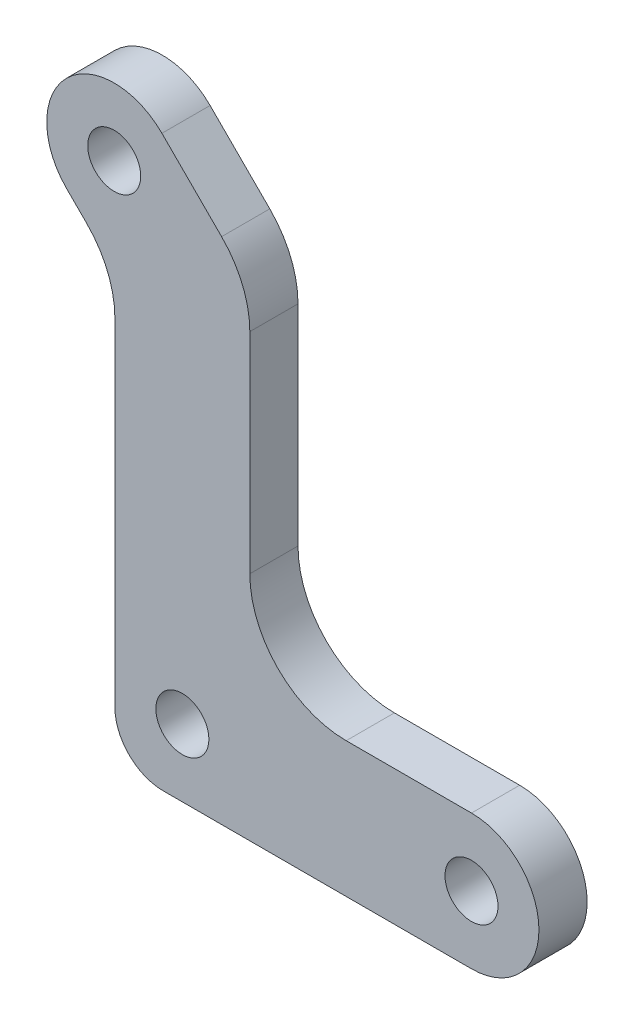
ISO-10303-21;
HEADER;
FILE_DESCRIPTION(('STEP AP214'),'2;1');
FILE_NAME('part.step','',(''),(''),'','','');
FILE_SCHEMA(('AUTOMOTIVE_DESIGN { 1 0 10303 214 1 1 1 1 }'));
ENDSEC;
DATA;
#1=APPLICATION_CONTEXT('core data for automotive mechanical design processes');
#2=APPLICATION_PROTOCOL_DEFINITION('international standard','automotive_design',2000,#1);
#3=PRODUCT_CONTEXT('',#1,'mechanical');
#4=PRODUCT('Part','Part','',(#3));
#5=PRODUCT_RELATED_PRODUCT_CATEGORY('part','',(#4));
#6=PRODUCT_DEFINITION_FORMATION('','',#4);
#7=PRODUCT_DEFINITION_CONTEXT('part definition',#1,'design');
#8=PRODUCT_DEFINITION('design','',#6,#7);
#9=PRODUCT_DEFINITION_SHAPE('','',#8);
#10=(LENGTH_UNIT() NAMED_UNIT(*) SI_UNIT(.MILLI.,.METRE.));
#11=(NAMED_UNIT(*) PLANE_ANGLE_UNIT() SI_UNIT($,.RADIAN.));
#12=(NAMED_UNIT(*) SI_UNIT($,.STERADIAN.) SOLID_ANGLE_UNIT());
#13=UNCERTAINTY_MEASURE_WITH_UNIT(LENGTH_MEASURE(1.E-05),#10,'distance_accuracy_value','');
#14=(GEOMETRIC_REPRESENTATION_CONTEXT(3) GLOBAL_UNCERTAINTY_ASSIGNED_CONTEXT((#13)) GLOBAL_UNIT_ASSIGNED_CONTEXT((#10,
#11,#12)) REPRESENTATION_CONTEXT('',''));
#15=CARTESIAN_POINT('',(0.,0.,0.));
#16=DIRECTION('',(0.,0.,1.));
#17=DIRECTION('',(1.,0.,0.));
#18=AXIS2_PLACEMENT_3D('',#15,#16,#17);
#19=CARTESIAN_POINT('',(-3.,38.7573593128807,5.));
#20=DIRECTION('',(0.,0.,1.));
#21=DIRECTION('',(1.,0.,0.));
#22=AXIS2_PLACEMENT_3D('',#19,#20,#21);
#23=PLANE('',#22);
#24=CARTESIAN_POINT('',(-7.07106781186552,47.0710678118654,5.));
#25=DIRECTION('',(0.,0.,1.));
#26=DIRECTION('',(1.,0.,0.));
#27=AXIS2_PLACEMENT_3D('',#24,#25,#26);
#28=CIRCLE('',#27,2.75);
#29=CARTESIAN_POINT('',(-4.32106781186552,47.0710678118654,5.));
#30=VERTEX_POINT('',#29);
#31=EDGE_CURVE('E400',#30,#30,#28,.T.);
#32=ORIENTED_EDGE('',*,*,#31,.F.);
#33=EDGE_LOOP('',(#32));
#34=FACE_BOUND('',#33,.T.);
#35=CARTESIAN_POINT('',(-3.,38.7573593128807,5.));
#36=DIRECTION('',(0.,0.,1.));
#37=DIRECTION('',(1.,0.,0.));
#38=AXIS2_PLACEMENT_3D('',#35,#36,#37);
#39=CIRCLE('',#38,10.);
#40=CARTESIAN_POINT('',(7.,38.7573593128807,5.));
#41=VERTEX_POINT('',#40);
#42=CARTESIAN_POINT('',(4.07106781186541,45.8284271247463,5.));
#43=VERTEX_POINT('',#42);
#44=EDGE_CURVE('E305',#41,#43,#39,.T.);
#45=ORIENTED_EDGE('',*,*,#44,.T.);
#46=DIRECTION('',(-0.707106781186551,0.707106781186544,0.));
#47=VECTOR('',#46,1.);
#48=CARTESIAN_POINT('',(4.07106781186541,45.8284271247463,5.));
#49=LINE('',#48,#47);
#50=CARTESIAN_POINT('',(-2.12132034355971,52.0208152801713,5.));
#51=VERTEX_POINT('',#50);
#52=EDGE_CURVE('E218',#43,#51,#49,.T.);
#53=ORIENTED_EDGE('',*,*,#52,.T.);
#54=CARTESIAN_POINT('',(-7.07106781186552,47.0710678118654,5.));
#55=DIRECTION('',(0.,0.,1.));
#56=DIRECTION('',(1.,0.,0.));
#57=AXIS2_PLACEMENT_3D('',#54,#55,#56);
#58=CIRCLE('',#57,7.);
#59=CARTESIAN_POINT('',(-12.0208152801713,42.1213203435596,5.));
#60=VERTEX_POINT('',#59);
#61=EDGE_CURVE('E326',#51,#60,#58,.T.);
#62=ORIENTED_EDGE('',*,*,#61,.T.);
#63=DIRECTION('',(-0.707106781186551,0.707106781186544,0.));
#64=VECTOR('',#63,1.);
#65=CARTESIAN_POINT('',(-9.92893218813459,40.0294372515229,5.));
#66=LINE('',#65,#64);
#67=CARTESIAN_POINT('',(-9.92893218813459,40.0294372515229,5.));
#68=VERTEX_POINT('',#67);
#69=EDGE_CURVE('E337',#68,#60,#66,.T.);
#70=ORIENTED_EDGE('',*,*,#69,.F.);
#71=CARTESIAN_POINT('',(-17.,32.9583694396573,5.));
#72=DIRECTION('',(0.,0.,1.));
#73=DIRECTION('',(1.,0.,0.));
#74=AXIS2_PLACEMENT_3D('',#71,#72,#73);
#75=CIRCLE('',#74,10.);
#76=CARTESIAN_POINT('',(-7.,32.9583694396573,5.));
#77=VERTEX_POINT('',#76);
#78=EDGE_CURVE('E340',#77,#68,#75,.T.);
#79=ORIENTED_EDGE('',*,*,#78,.F.);
#80=DIRECTION('',(0.,-1.,0.));
#81=VECTOR('',#80,1.);
#82=CARTESIAN_POINT('',(-7.,32.9583694396573,5.));
#83=LINE('',#82,#81);
#84=CARTESIAN_POINT('',(-7.,-2.,5.));
#85=VERTEX_POINT('',#84);
#86=EDGE_CURVE('E342',#77,#85,#83,.T.);
#87=ORIENTED_EDGE('',*,*,#86,.T.);
#88=CARTESIAN_POINT('',(-2.,-2.,5.));
#89=DIRECTION('',(0.,0.,-1.));
#90=DIRECTION('',(-1.,0.,0.));
#91=AXIS2_PLACEMENT_3D('',#88,#89,#90);
#92=CIRCLE('',#91,5.);
#93=CARTESIAN_POINT('',(-1.99999999999996,-7.,5.));
#94=VERTEX_POINT('',#93);
#95=EDGE_CURVE('E348',#94,#85,#92,.T.);
#96=ORIENTED_EDGE('',*,*,#95,.F.);
#97=DIRECTION('',(1.,0.,0.));
#98=VECTOR('',#97,1.);
#99=CARTESIAN_POINT('',(-1.99999999999996,-7.,5.));
#100=LINE('',#99,#98);
#101=CARTESIAN_POINT('',(30.,-7.,5.));
#102=VERTEX_POINT('',#101);
#103=EDGE_CURVE('E268',#94,#102,#100,.T.);
#104=ORIENTED_EDGE('',*,*,#103,.T.);
#105=CARTESIAN_POINT('',(30.,0.,5.));
#106=DIRECTION('',(0.,0.,-1.));
#107=DIRECTION('',(-1.,0.,0.));
#108=AXIS2_PLACEMENT_3D('',#105,#106,#107);
#109=CIRCLE('',#108,7.);
#110=CARTESIAN_POINT('',(30.,7.,5.));
#111=VERTEX_POINT('',#110);
#112=EDGE_CURVE('E266',#111,#102,#109,.T.);
#113=ORIENTED_EDGE('',*,*,#112,.F.);
#114=DIRECTION('',(1.,0.,0.));
#115=VECTOR('',#114,1.);
#116=CARTESIAN_POINT('',(17.,7.,5.));
#117=LINE('',#116,#115);
#118=CARTESIAN_POINT('',(17.,7.,5.));
#119=VERTEX_POINT('',#118);
#120=EDGE_CURVE('E250',#119,#111,#117,.T.);
#121=ORIENTED_EDGE('',*,*,#120,.F.);
#122=CARTESIAN_POINT('',(17.,17.,5.));
#123=DIRECTION('',(0.,0.,-1.));
#124=DIRECTION('',(-1.,0.,0.));
#125=AXIS2_PLACEMENT_3D('',#122,#123,#124);
#126=CIRCLE('',#125,10.);
#127=CARTESIAN_POINT('',(7.,17.,5.));
#128=VERTEX_POINT('',#127);
#129=EDGE_CURVE('E257',#119,#128,#126,.T.);
#130=ORIENTED_EDGE('',*,*,#129,.T.);
#131=DIRECTION('',(0.,-1.,0.));
#132=VECTOR('',#131,1.);
#133=CARTESIAN_POINT('',(7.,38.7573593128807,5.));
#134=LINE('',#133,#132);
#135=EDGE_CURVE('E261',#41,#128,#134,.T.);
#136=ORIENTED_EDGE('',*,*,#135,.F.);
#137=EDGE_LOOP('',(#45,#53,#62,#70,#79,#87,#96,#104,#113,#121,#130,#136));
#138=FACE_BOUND('',#137,.T.);
#139=CARTESIAN_POINT('',(0.,0.,5.));
#140=DIRECTION('',(0.,0.,1.));
#141=DIRECTION('',(1.,0.,0.));
#142=AXIS2_PLACEMENT_3D('',#139,#140,#141);
#143=CIRCLE('',#142,2.75);
#144=CARTESIAN_POINT('',(2.75,0.,5.));
#145=VERTEX_POINT('',#144);
#146=EDGE_CURVE('E276',#145,#145,#143,.T.);
#147=ORIENTED_EDGE('',*,*,#146,.F.);
#148=EDGE_LOOP('',(#147));
#149=FACE_BOUND('',#148,.T.);
#150=CARTESIAN_POINT('',(30.,0.,5.));
#151=DIRECTION('',(0.,0.,1.));
#152=DIRECTION('',(1.,0.,0.));
#153=AXIS2_PLACEMENT_3D('',#150,#151,#152);
#154=CIRCLE('',#153,2.74999999999999);
#155=CARTESIAN_POINT('',(32.75,0.,5.));
#156=VERTEX_POINT('',#155);
#157=EDGE_CURVE('E391',#156,#156,#154,.T.);
#158=ORIENTED_EDGE('',*,*,#157,.F.);
#159=EDGE_LOOP('',(#158));
#160=FACE_BOUND('',#159,.T.);
#161=ADVANCED_FACE('F150',(#34,#138,#149,#160),#23,.T.);
#162=CARTESIAN_POINT('',(-3.,38.7573593128807,0.));
#163=DIRECTION('',(0.,0.,1.));
#164=DIRECTION('',(1.,0.,0.));
#165=AXIS2_PLACEMENT_3D('',#162,#163,#164);
#166=PLANE('',#165);
#167=CARTESIAN_POINT('',(-3.,38.7573593128807,0.));
#168=DIRECTION('',(0.,0.,1.));
#169=DIRECTION('',(1.,0.,0.));
#170=AXIS2_PLACEMENT_3D('',#167,#168,#169);
#171=CIRCLE('',#170,10.);
#172=CARTESIAN_POINT('',(7.,38.7573593128807,0.));
#173=VERTEX_POINT('',#172);
#174=CARTESIAN_POINT('',(4.07106781186541,45.8284271247463,0.));
#175=VERTEX_POINT('',#174);
#176=EDGE_CURVE('E273',#173,#175,#171,.T.);
#177=ORIENTED_EDGE('',*,*,#176,.F.);
#178=DIRECTION('',(0.,-1.,0.));
#179=VECTOR('',#178,1.);
#180=CARTESIAN_POINT('',(7.,38.7573593128807,0.));
#181=LINE('',#180,#179);
#182=CARTESIAN_POINT('',(7.,17.,0.));
#183=VERTEX_POINT('',#182);
#184=EDGE_CURVE('E302',#173,#183,#181,.T.);
#185=ORIENTED_EDGE('',*,*,#184,.T.);
#186=CARTESIAN_POINT('',(17.,17.,0.));
#187=DIRECTION('',(0.,0.,-1.));
#188=DIRECTION('',(-1.,0.,0.));
#189=AXIS2_PLACEMENT_3D('',#186,#187,#188);
#190=CIRCLE('',#189,10.);
#191=CARTESIAN_POINT('',(17.,7.,0.));
#192=VERTEX_POINT('',#191);
#193=EDGE_CURVE('E300',#192,#183,#190,.T.);
#194=ORIENTED_EDGE('',*,*,#193,.F.);
#195=DIRECTION('',(1.,0.,0.));
#196=VECTOR('',#195,1.);
#197=CARTESIAN_POINT('',(17.,7.,0.));
#198=LINE('',#197,#196);
#199=CARTESIAN_POINT('',(30.,7.,0.));
#200=VERTEX_POINT('',#199);
#201=EDGE_CURVE('E252',#192,#200,#198,.T.);
#202=ORIENTED_EDGE('',*,*,#201,.T.);
#203=CARTESIAN_POINT('',(30.,0.,0.));
#204=DIRECTION('',(0.,0.,-1.));
#205=DIRECTION('',(-1.,0.,0.));
#206=AXIS2_PLACEMENT_3D('',#203,#204,#205);
#207=CIRCLE('',#206,7.);
#208=CARTESIAN_POINT('',(30.,-7.,0.));
#209=VERTEX_POINT('',#208);
#210=EDGE_CURVE('E296',#200,#209,#207,.T.);
#211=ORIENTED_EDGE('',*,*,#210,.T.);
#212=DIRECTION('',(1.,0.,0.));
#213=VECTOR('',#212,1.);
#214=CARTESIAN_POINT('',(-1.99999999999996,-7.,0.));
#215=LINE('',#214,#213);
#216=CARTESIAN_POINT('',(-1.99999999999996,-7.,0.));
#217=VERTEX_POINT('',#216);
#218=EDGE_CURVE('E293',#217,#209,#215,.T.);
#219=ORIENTED_EDGE('',*,*,#218,.F.);
#220=CARTESIAN_POINT('',(-2.,-2.,0.));
#221=DIRECTION('',(0.,0.,-1.));
#222=DIRECTION('',(-1.,0.,0.));
#223=AXIS2_PLACEMENT_3D('',#220,#221,#222);
#224=CIRCLE('',#223,5.);
#225=CARTESIAN_POINT('',(-7.,-2.,0.));
#226=VERTEX_POINT('',#225);
#227=EDGE_CURVE('E290',#217,#226,#224,.T.);
#228=ORIENTED_EDGE('',*,*,#227,.T.);
#229=DIRECTION('',(0.,-1.,0.));
#230=VECTOR('',#229,1.);
#231=CARTESIAN_POINT('',(-7.,32.9583694396573,0.));
#232=LINE('',#231,#230);
#233=CARTESIAN_POINT('',(-7.,32.9583694396573,0.));
#234=VERTEX_POINT('',#233);
#235=EDGE_CURVE('E287',#234,#226,#232,.T.);
#236=ORIENTED_EDGE('',*,*,#235,.F.);
#237=CARTESIAN_POINT('',(-17.,32.9583694396573,0.));
#238=DIRECTION('',(0.,0.,1.));
#239=DIRECTION('',(1.,0.,0.));
#240=AXIS2_PLACEMENT_3D('',#237,#238,#239);
#241=CIRCLE('',#240,10.);
#242=CARTESIAN_POINT('',(-9.92893218813459,40.0294372515229,0.));
#243=VERTEX_POINT('',#242);
#244=EDGE_CURVE('E284',#234,#243,#241,.T.);
#245=ORIENTED_EDGE('',*,*,#244,.T.);
#246=DIRECTION('',(-0.707106781186551,0.707106781186544,0.));
#247=VECTOR('',#246,1.);
#248=CARTESIAN_POINT('',(-9.92893218813459,40.0294372515229,0.));
#249=LINE('',#248,#247);
#250=CARTESIAN_POINT('',(-12.0208152801713,42.1213203435596,0.));
#251=VERTEX_POINT('',#250);
#252=EDGE_CURVE('E281',#243,#251,#249,.T.);
#253=ORIENTED_EDGE('',*,*,#252,.T.);
#254=CARTESIAN_POINT('',(-7.07106781186552,47.0710678118654,0.));
#255=DIRECTION('',(0.,0.,1.));
#256=DIRECTION('',(1.,0.,0.));
#257=AXIS2_PLACEMENT_3D('',#254,#255,#256);
#258=CIRCLE('',#257,7.);
#259=CARTESIAN_POINT('',(-2.12132034355971,52.0208152801713,0.));
#260=VERTEX_POINT('',#259);
#261=EDGE_CURVE('E278',#260,#251,#258,.T.);
#262=ORIENTED_EDGE('',*,*,#261,.F.);
#263=DIRECTION('',(-0.707106781186551,0.707106781186544,0.));
#264=VECTOR('',#263,1.);
#265=CARTESIAN_POINT('',(4.07106781186541,45.8284271247463,0.));
#266=LINE('',#265,#264);
#267=EDGE_CURVE('E275',#175,#260,#266,.T.);
#268=ORIENTED_EDGE('',*,*,#267,.F.);
#269=EDGE_LOOP('',(#177,#185,#194,#202,#211,#219,#228,#236,#245,#253,#262,#268));
#270=FACE_BOUND('',#269,.T.);
#271=CARTESIAN_POINT('',(0.,0.,0.));
#272=DIRECTION('',(0.,0.,1.));
#273=DIRECTION('',(1.,0.,0.));
#274=AXIS2_PLACEMENT_3D('',#271,#272,#273);
#275=CIRCLE('',#274,2.75);
#276=CARTESIAN_POINT('',(2.75,0.,0.));
#277=VERTEX_POINT('',#276);
#278=EDGE_CURVE('E403',#277,#277,#275,.T.);
#279=ORIENTED_EDGE('',*,*,#278,.T.);
#280=EDGE_LOOP('',(#279));
#281=FACE_BOUND('',#280,.T.);
#282=CARTESIAN_POINT('',(-7.07106781186552,47.0710678118654,0.));
#283=DIRECTION('',(0.,0.,1.));
#284=DIRECTION('',(1.,0.,0.));
#285=AXIS2_PLACEMENT_3D('',#282,#283,#284);
#286=CIRCLE('',#285,2.75);
#287=CARTESIAN_POINT('',(-4.32106781186552,47.0710678118654,0.));
#288=VERTEX_POINT('',#287);
#289=EDGE_CURVE('E397',#288,#288,#286,.T.);
#290=ORIENTED_EDGE('',*,*,#289,.T.);
#291=EDGE_LOOP('',(#290));
#292=FACE_BOUND('',#291,.T.);
#293=CARTESIAN_POINT('',(30.,0.,0.));
#294=DIRECTION('',(0.,0.,1.));
#295=DIRECTION('',(1.,0.,0.));
#296=AXIS2_PLACEMENT_3D('',#293,#294,#295);
#297=CIRCLE('',#296,2.74999999999999);
#298=CARTESIAN_POINT('',(32.75,0.,0.));
#299=VERTEX_POINT('',#298);
#300=EDGE_CURVE('E394',#299,#299,#297,.T.);
#301=ORIENTED_EDGE('',*,*,#300,.T.);
#302=EDGE_LOOP('',(#301));
#303=FACE_BOUND('',#302,.T.);
#304=ADVANCED_FACE('F328',(#270,#281,#292,#303),#166,.F.);
#305=CARTESIAN_POINT('',(-3.,38.7573593128807,5.));
#306=DIRECTION('',(0.,0.,-1.));
#307=DIRECTION('',(-1.,0.,0.));
#308=AXIS2_PLACEMENT_3D('',#305,#306,#307);
#309=CYLINDRICAL_SURFACE('',#308,10.);
#310=ORIENTED_EDGE('',*,*,#176,.T.);
#311=DIRECTION('',(0.,0.,-1.));
#312=VECTOR('',#311,1.);
#313=CARTESIAN_POINT('',(4.07106781186541,45.8284271247463,5.));
#314=LINE('',#313,#312);
#315=EDGE_CURVE('E12',#43,#175,#314,.T.);
#316=ORIENTED_EDGE('',*,*,#315,.F.);
#317=ORIENTED_EDGE('',*,*,#44,.F.);
#318=DIRECTION('',(0.,0.,-1.));
#319=VECTOR('',#318,1.);
#320=CARTESIAN_POINT('',(7.,38.7573593128807,5.));
#321=LINE('',#320,#319);
#322=EDGE_CURVE('E167',#41,#173,#321,.T.);
#323=ORIENTED_EDGE('',*,*,#322,.T.);
#324=EDGE_LOOP('',(#310,#316,#317,#323));
#325=FACE_BOUND('',#324,.T.);
#326=ADVANCED_FACE('F152',(#325),#309,.T.);
#327=CARTESIAN_POINT('',(4.07106781186541,45.8284271247463,5.));
#328=DIRECTION('',(-0.707106781186544,-0.707106781186551,0.));
#329=DIRECTION('',(0.707106781186551,-0.707106781186544,0.));
#330=AXIS2_PLACEMENT_3D('',#327,#328,#329);
#331=PLANE('',#330);
#332=ORIENTED_EDGE('',*,*,#267,.T.);
#333=DIRECTION('',(0.,0.,-1.));
#334=VECTOR('',#333,1.);
#335=CARTESIAN_POINT('',(-2.12132034355971,52.0208152801713,5.));
#336=LINE('',#335,#334);
#337=EDGE_CURVE('E159',#51,#260,#336,.T.);
#338=ORIENTED_EDGE('',*,*,#337,.F.);
#339=ORIENTED_EDGE('',*,*,#52,.F.);
#340=ORIENTED_EDGE('',*,*,#315,.T.);
#341=EDGE_LOOP('',(#332,#338,#339,#340));
#342=FACE_BOUND('',#341,.T.);
#343=ADVANCED_FACE('F411',(#342),#331,.F.);
#344=CARTESIAN_POINT('',(-7.07106781186552,47.0710678118654,5.));
#345=DIRECTION('',(0.,0.,-1.));
#346=DIRECTION('',(-1.,0.,0.));
#347=AXIS2_PLACEMENT_3D('',#344,#345,#346);
#348=CYLINDRICAL_SURFACE('',#347,7.);
#349=ORIENTED_EDGE('',*,*,#261,.T.);
#350=DIRECTION('',(0.,0.,-1.));
#351=VECTOR('',#350,1.);
#352=CARTESIAN_POINT('',(-12.0208152801713,42.1213203435596,5.));
#353=LINE('',#352,#351);
#354=EDGE_CURVE('E319',#60,#251,#353,.T.);
#355=ORIENTED_EDGE('',*,*,#354,.F.);
#356=ORIENTED_EDGE('',*,*,#61,.F.);
#357=ORIENTED_EDGE('',*,*,#337,.T.);
#358=EDGE_LOOP('',(#349,#355,#356,#357));
#359=FACE_BOUND('',#358,.T.);
#360=ADVANCED_FACE('F324',(#359),#348,.T.);
#361=CARTESIAN_POINT('',(-9.92893218813459,40.0294372515229,5.));
#362=DIRECTION('',(-0.707106781186544,-0.707106781186551,0.));
#363=DIRECTION('',(0.707106781186551,-0.707106781186544,0.));
#364=AXIS2_PLACEMENT_3D('',#361,#362,#363);
#365=PLANE('',#364);
#366=ORIENTED_EDGE('',*,*,#252,.F.);
#367=DIRECTION('',(0.,0.,-1.));
#368=VECTOR('',#367,1.);
#369=CARTESIAN_POINT('',(-9.92893218813459,40.0294372515229,5.));
#370=LINE('',#369,#368);
#371=EDGE_CURVE('E317',#68,#243,#370,.T.);
#372=ORIENTED_EDGE('',*,*,#371,.F.);
#373=ORIENTED_EDGE('',*,*,#69,.T.);
#374=ORIENTED_EDGE('',*,*,#354,.T.);
#375=EDGE_LOOP('',(#366,#372,#373,#374));
#376=FACE_BOUND('',#375,.T.);
#377=ADVANCED_FACE('F334',(#376),#365,.T.);
#378=CARTESIAN_POINT('',(-17.,32.9583694396573,5.));
#379=DIRECTION('',(0.,0.,-1.));
#380=DIRECTION('',(-1.,0.,0.));
#381=AXIS2_PLACEMENT_3D('',#378,#379,#380);
#382=CYLINDRICAL_SURFACE('',#381,10.);
#383=ORIENTED_EDGE('',*,*,#244,.F.);
#384=DIRECTION('',(0.,0.,-1.));
#385=VECTOR('',#384,1.);
#386=CARTESIAN_POINT('',(-7.,32.9583694396573,5.));
#387=LINE('',#386,#385);
#388=EDGE_CURVE('E315',#77,#234,#387,.T.);
#389=ORIENTED_EDGE('',*,*,#388,.F.);
#390=ORIENTED_EDGE('',*,*,#78,.T.);
#391=ORIENTED_EDGE('',*,*,#371,.T.);
#392=EDGE_LOOP('',(#383,#389,#390,#391));
#393=FACE_BOUND('',#392,.T.);
#394=ADVANCED_FACE('F421',(#393),#382,.F.);
#395=CARTESIAN_POINT('',(-7.,32.9583694396573,5.));
#396=DIRECTION('',(1.,0.,0.));
#397=DIRECTION('',(0.,0.,-1.));
#398=AXIS2_PLACEMENT_3D('',#395,#396,#397);
#399=PLANE('',#398);
#400=ORIENTED_EDGE('',*,*,#235,.T.);
#401=DIRECTION('',(0.,0.,-1.));
#402=VECTOR('',#401,1.);
#403=CARTESIAN_POINT('',(-7.,-2.,5.));
#404=LINE('',#403,#402);
#405=EDGE_CURVE('E313',#85,#226,#404,.T.);
#406=ORIENTED_EDGE('',*,*,#405,.F.);
#407=ORIENTED_EDGE('',*,*,#86,.F.);
#408=ORIENTED_EDGE('',*,*,#388,.T.);
#409=EDGE_LOOP('',(#400,#406,#407,#408));
#410=FACE_BOUND('',#409,.T.);
#411=ADVANCED_FACE('F424',(#410),#399,.F.);
#412=CARTESIAN_POINT('',(-2.,-2.,5.));
#413=DIRECTION('',(0.,0.,-1.));
#414=DIRECTION('',(-1.,0.,0.));
#415=AXIS2_PLACEMENT_3D('',#412,#413,#414);
#416=CYLINDRICAL_SURFACE('',#415,5.);
#417=ORIENTED_EDGE('',*,*,#227,.F.);
#418=DIRECTION('',(0.,0.,-1.));
#419=VECTOR('',#418,1.);
#420=CARTESIAN_POINT('',(-1.99999999999996,-7.,5.));
#421=LINE('',#420,#419);
#422=EDGE_CURVE('E311',#94,#217,#421,.T.);
#423=ORIENTED_EDGE('',*,*,#422,.F.);
#424=ORIENTED_EDGE('',*,*,#95,.T.);
#425=ORIENTED_EDGE('',*,*,#405,.T.);
#426=EDGE_LOOP('',(#417,#423,#424,#425));
#427=FACE_BOUND('',#426,.T.);
#428=ADVANCED_FACE('F428',(#427),#416,.T.);
#429=CARTESIAN_POINT('',(-1.99999999999996,-7.,5.));
#430=DIRECTION('',(0.,1.,0.));
#431=DIRECTION('',(-1.,0.,0.));
#432=AXIS2_PLACEMENT_3D('',#429,#430,#431);
#433=PLANE('',#432);
#434=ORIENTED_EDGE('',*,*,#218,.T.);
#435=DIRECTION('',(0.,0.,-1.));
#436=VECTOR('',#435,1.);
#437=CARTESIAN_POINT('',(30.,-7.,5.));
#438=LINE('',#437,#436);
#439=EDGE_CURVE('E309',#102,#209,#438,.T.);
#440=ORIENTED_EDGE('',*,*,#439,.F.);
#441=ORIENTED_EDGE('',*,*,#103,.F.);
#442=ORIENTED_EDGE('',*,*,#422,.T.);
#443=EDGE_LOOP('',(#434,#440,#441,#442));
#444=FACE_BOUND('',#443,.T.);
#445=ADVANCED_FACE('F354',(#444),#433,.F.);
#446=CARTESIAN_POINT('',(30.,0.,5.));
#447=DIRECTION('',(0.,0.,-1.));
#448=DIRECTION('',(-1.,0.,0.));
#449=AXIS2_PLACEMENT_3D('',#446,#447,#448);
#450=CYLINDRICAL_SURFACE('',#449,7.);
#451=ORIENTED_EDGE('',*,*,#210,.F.);
#452=DIRECTION('',(0.,0.,-1.));
#453=VECTOR('',#452,1.);
#454=CARTESIAN_POINT('',(30.,7.,5.));
#455=LINE('',#454,#453);
#456=EDGE_CURVE('E255',#111,#200,#455,.T.);
#457=ORIENTED_EDGE('',*,*,#456,.F.);
#458=ORIENTED_EDGE('',*,*,#112,.T.);
#459=ORIENTED_EDGE('',*,*,#439,.T.);
#460=EDGE_LOOP('',(#451,#457,#458,#459));
#461=FACE_BOUND('',#460,.T.);
#462=ADVANCED_FACE('F358',(#461),#450,.T.);
#463=CARTESIAN_POINT('',(17.,7.,5.));
#464=DIRECTION('',(0.,1.,0.));
#465=DIRECTION('',(-1.,0.,0.));
#466=AXIS2_PLACEMENT_3D('',#463,#464,#465);
#467=PLANE('',#466);
#468=ORIENTED_EDGE('',*,*,#201,.F.);
#469=DIRECTION('',(0.,0.,-1.));
#470=VECTOR('',#469,1.);
#471=CARTESIAN_POINT('',(17.,7.,5.));
#472=LINE('',#471,#470);
#473=EDGE_CURVE('E246',#119,#192,#472,.T.);
#474=ORIENTED_EDGE('',*,*,#473,.F.);
#475=ORIENTED_EDGE('',*,*,#120,.T.);
#476=ORIENTED_EDGE('',*,*,#456,.T.);
#477=EDGE_LOOP('',(#468,#474,#475,#476));
#478=FACE_BOUND('',#477,.T.);
#479=ADVANCED_FACE('F248',(#478),#467,.T.);
#480=CARTESIAN_POINT('',(17.,17.,5.));
#481=DIRECTION('',(0.,0.,-1.));
#482=DIRECTION('',(-1.,0.,0.));
#483=AXIS2_PLACEMENT_3D('',#480,#481,#482);
#484=CYLINDRICAL_SURFACE('',#483,10.);
#485=ORIENTED_EDGE('',*,*,#193,.T.);
#486=DIRECTION('',(0.,0.,-1.));
#487=VECTOR('',#486,1.);
#488=CARTESIAN_POINT('',(7.,17.,5.));
#489=LINE('',#488,#487);
#490=EDGE_CURVE('E206',#128,#183,#489,.T.);
#491=ORIENTED_EDGE('',*,*,#490,.F.);
#492=ORIENTED_EDGE('',*,*,#129,.F.);
#493=ORIENTED_EDGE('',*,*,#473,.T.);
#494=EDGE_LOOP('',(#485,#491,#492,#493));
#495=FACE_BOUND('',#494,.T.);
#496=ADVANCED_FACE('F258',(#495),#484,.F.);
#497=CARTESIAN_POINT('',(7.,38.7573593128807,5.));
#498=DIRECTION('',(1.,0.,0.));
#499=DIRECTION('',(0.,1.,0.));
#500=AXIS2_PLACEMENT_3D('',#497,#498,#499);
#501=PLANE('',#500);
#502=ORIENTED_EDGE('',*,*,#184,.F.);
#503=ORIENTED_EDGE('',*,*,#322,.F.);
#504=ORIENTED_EDGE('',*,*,#135,.T.);
#505=ORIENTED_EDGE('',*,*,#490,.T.);
#506=EDGE_LOOP('',(#502,#503,#504,#505));
#507=FACE_BOUND('',#506,.T.);
#508=ADVANCED_FACE('F359',(#507),#501,.T.);
#509=CARTESIAN_POINT('',(0.,0.,5.));
#510=DIRECTION('',(0.,0.,-1.));
#511=DIRECTION('',(-1.,0.,0.));
#512=AXIS2_PLACEMENT_3D('',#509,#510,#511);
#513=CYLINDRICAL_SURFACE('',#512,2.75);
#514=ORIENTED_EDGE('',*,*,#146,.T.);
#515=EDGE_LOOP('',(#514));
#516=FACE_BOUND('',#515,.T.);
#517=ORIENTED_EDGE('',*,*,#278,.F.);
#518=EDGE_LOOP('',(#517));
#519=FACE_BOUND('',#518,.T.);
#520=ADVANCED_FACE('F361',(#516,#519),#513,.F.);
#521=CARTESIAN_POINT('',(-7.07106781186552,47.0710678118654,5.));
#522=DIRECTION('',(0.,0.,-1.));
#523=DIRECTION('',(-1.,0.,0.));
#524=AXIS2_PLACEMENT_3D('',#521,#522,#523);
#525=CYLINDRICAL_SURFACE('',#524,2.75);
#526=ORIENTED_EDGE('',*,*,#31,.T.);
#527=EDGE_LOOP('',(#526));
#528=FACE_BOUND('',#527,.T.);
#529=ORIENTED_EDGE('',*,*,#289,.F.);
#530=EDGE_LOOP('',(#529));
#531=FACE_BOUND('',#530,.T.);
#532=ADVANCED_FACE('F367',(#528,#531),#525,.F.);
#533=CARTESIAN_POINT('',(30.,0.,5.));
#534=DIRECTION('',(0.,0.,-1.));
#535=DIRECTION('',(-1.,0.,0.));
#536=AXIS2_PLACEMENT_3D('',#533,#534,#535);
#537=CYLINDRICAL_SURFACE('',#536,2.74999999999999);
#538=ORIENTED_EDGE('',*,*,#157,.T.);
#539=EDGE_LOOP('',(#538));
#540=FACE_BOUND('',#539,.T.);
#541=ORIENTED_EDGE('',*,*,#300,.F.);
#542=EDGE_LOOP('',(#541));
#543=FACE_BOUND('',#542,.T.);
#544=ADVANCED_FACE('F382',(#540,#543),#537,.F.);
#545=CLOSED_SHELL('',(#161,#304,#326,#343,#360,#377,#394,#411,#428,#445,#462,#479,#496,#508,
#520,#532,#544));
#546=MANIFOLD_SOLID_BREP('B2',#545);
#547=ADVANCED_BREP_SHAPE_REPRESENTATION('',(#18,#546),#14);
#548=SHAPE_DEFINITION_REPRESENTATION(#9,#547);
ENDSEC;
END-ISO-10303-21;
